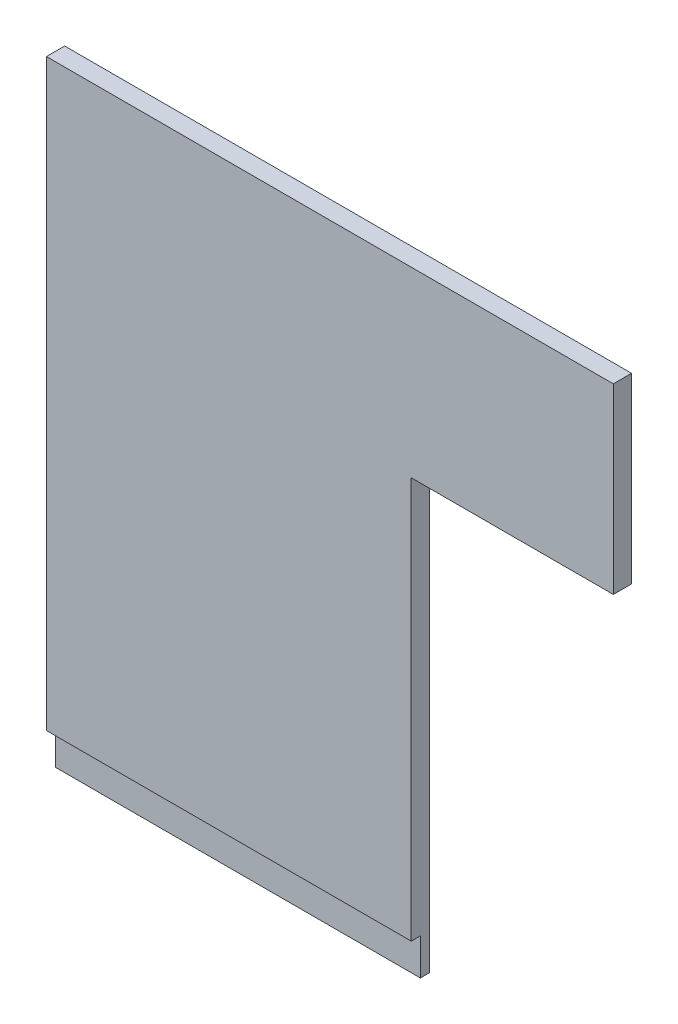
ISO-10303-21;
HEADER;
FILE_DESCRIPTION(('STEP AP214'),'2;1');
FILE_NAME('part.step','',(''),(''),'','','');
FILE_SCHEMA(('AUTOMOTIVE_DESIGN { 1 0 10303 214 1 1 1 1 }'));
ENDSEC;
DATA;
#1=APPLICATION_CONTEXT('core data for automotive mechanical design processes');
#2=APPLICATION_PROTOCOL_DEFINITION('international standard','automotive_design',2000,#1);
#3=PRODUCT_CONTEXT('',#1,'mechanical');
#4=PRODUCT('Part','Part','',(#3));
#5=PRODUCT_RELATED_PRODUCT_CATEGORY('part','',(#4));
#6=PRODUCT_DEFINITION_FORMATION('','',#4);
#7=PRODUCT_DEFINITION_CONTEXT('part definition',#1,'design');
#8=PRODUCT_DEFINITION('design','',#6,#7);
#9=PRODUCT_DEFINITION_SHAPE('','',#8);
#10=(LENGTH_UNIT() NAMED_UNIT(*) SI_UNIT(.MILLI.,.METRE.));
#11=(NAMED_UNIT(*) PLANE_ANGLE_UNIT() SI_UNIT($,.RADIAN.));
#12=(NAMED_UNIT(*) SI_UNIT($,.STERADIAN.) SOLID_ANGLE_UNIT());
#13=UNCERTAINTY_MEASURE_WITH_UNIT(LENGTH_MEASURE(1.E-05),#10,'distance_accuracy_value','');
#14=(GEOMETRIC_REPRESENTATION_CONTEXT(3) GLOBAL_UNCERTAINTY_ASSIGNED_CONTEXT((#13)) GLOBAL_UNIT_ASSIGNED_CONTEXT((#10,
#11,#12)) REPRESENTATION_CONTEXT('',''));
#15=CARTESIAN_POINT('',(0.,0.,0.));
#16=DIRECTION('',(0.,0.,1.));
#17=DIRECTION('',(1.,0.,0.));
#18=AXIS2_PLACEMENT_3D('',#15,#16,#17);
#19=CARTESIAN_POINT('',(0.,0.,3.175));
#20=DIRECTION('',(1.,0.,0.));
#21=DIRECTION('',(0.,0.,-1.));
#22=AXIS2_PLACEMENT_3D('',#19,#20,#21);
#23=PLANE('',#22);
#24=DIRECTION('',(0.,-1.,0.));
#25=VECTOR('',#24,1.);
#26=CARTESIAN_POINT('',(0.,0.,1.5875));
#27=LINE('',#26,#25);
#28=CARTESIAN_POINT('',(0.,6.35,1.5875));
#29=VERTEX_POINT('',#28);
#30=CARTESIAN_POINT('',(0.,0.,1.5875));
#31=VERTEX_POINT('',#30);
#32=EDGE_CURVE('E117',#29,#31,#27,.T.);
#33=ORIENTED_EDGE('',*,*,#32,.F.);
#34=DIRECTION('',(0.,0.,1.));
#35=VECTOR('',#34,1.);
#36=CARTESIAN_POINT('',(0.,6.35,1.5875));
#37=LINE('',#36,#35);
#38=CARTESIAN_POINT('',(0.,6.35,3.175));
#39=VERTEX_POINT('',#38);
#40=EDGE_CURVE('E145',#29,#39,#37,.T.);
#41=ORIENTED_EDGE('',*,*,#40,.T.);
#42=DIRECTION('',(0.,-1.,0.));
#43=VECTOR('',#42,1.);
#44=CARTESIAN_POINT('',(0.,0.,3.175));
#45=LINE('',#44,#43);
#46=CARTESIAN_POINT('',(0.,107.95,3.175));
#47=VERTEX_POINT('',#46);
#48=EDGE_CURVE('E166',#47,#39,#45,.T.);
#49=ORIENTED_EDGE('',*,*,#48,.F.);
#50=DIRECTION('',(0.,0.,-1.));
#51=VECTOR('',#50,1.);
#52=CARTESIAN_POINT('',(0.,107.95,3.175));
#53=LINE('',#52,#51);
#54=CARTESIAN_POINT('',(0.,107.95,0.));
#55=VERTEX_POINT('',#54);
#56=EDGE_CURVE('E141',#47,#55,#53,.T.);
#57=ORIENTED_EDGE('',*,*,#56,.T.);
#58=DIRECTION('',(0.,-1.,0.));
#59=VECTOR('',#58,1.);
#60=CARTESIAN_POINT('',(0.,0.,0.));
#61=LINE('',#60,#59);
#62=CARTESIAN_POINT('',(0.,0.,0.));
#63=VERTEX_POINT('',#62);
#64=EDGE_CURVE('E139',#55,#63,#61,.T.);
#65=ORIENTED_EDGE('',*,*,#64,.T.);
#66=DIRECTION('',(0.,0.,-1.));
#67=VECTOR('',#66,1.);
#68=CARTESIAN_POINT('',(0.,0.,3.175));
#69=LINE('',#68,#67);
#70=EDGE_CURVE('E12',#31,#63,#69,.T.);
#71=ORIENTED_EDGE('',*,*,#70,.F.);
#72=EDGE_LOOP('',(#33,#41,#49,#57,#65,#71));
#73=FACE_BOUND('',#72,.T.);
#74=ADVANCED_FACE('F44',(#73),#23,.F.);
#75=CARTESIAN_POINT('',(0.,0.,3.175));
#76=DIRECTION('',(0.,1.,0.));
#77=DIRECTION('',(0.,0.,1.));
#78=AXIS2_PLACEMENT_3D('',#75,#76,#77);
#79=PLANE('',#78);
#80=DIRECTION('',(0.,0.,-1.));
#81=VECTOR('',#80,1.);
#82=CARTESIAN_POINT('',(63.5,0.,3.175));
#83=LINE('',#82,#81);
#84=CARTESIAN_POINT('',(63.5,0.,1.5875));
#85=VERTEX_POINT('',#84);
#86=CARTESIAN_POINT('',(63.5,0.,0.));
#87=VERTEX_POINT('',#86);
#88=EDGE_CURVE('E52',#85,#87,#83,.T.);
#89=ORIENTED_EDGE('',*,*,#88,.F.);
#90=DIRECTION('',(1.,0.,0.));
#91=VECTOR('',#90,1.);
#92=CARTESIAN_POINT('',(0.,0.,1.5875));
#93=LINE('',#92,#91);
#94=EDGE_CURVE('E120',#31,#85,#93,.T.);
#95=ORIENTED_EDGE('',*,*,#94,.F.);
#96=ORIENTED_EDGE('',*,*,#70,.T.);
#97=DIRECTION('',(1.,0.,0.));
#98=VECTOR('',#97,1.);
#99=CARTESIAN_POINT('',(0.,0.,0.));
#100=LINE('',#99,#98);
#101=EDGE_CURVE('E144',#63,#87,#100,.T.);
#102=ORIENTED_EDGE('',*,*,#101,.T.);
#103=EDGE_LOOP('',(#89,#95,#96,#102));
#104=FACE_BOUND('',#103,.T.);
#105=ADVANCED_FACE('F131',(#104),#79,.F.);
#106=CARTESIAN_POINT('',(63.5,0.,3.175));
#107=DIRECTION('',(-1.,0.,0.));
#108=DIRECTION('',(0.,0.,1.));
#109=AXIS2_PLACEMENT_3D('',#106,#107,#108);
#110=PLANE('',#109);
#111=DIRECTION('',(0.,1.,0.));
#112=VECTOR('',#111,1.);
#113=CARTESIAN_POINT('',(63.5,0.,3.175));
#114=LINE('',#113,#112);
#115=CARTESIAN_POINT('',(63.5,6.35,3.175));
#116=VERTEX_POINT('',#115);
#117=CARTESIAN_POINT('',(63.5,76.2,3.175));
#118=VERTEX_POINT('',#117);
#119=EDGE_CURVE('E99',#116,#118,#114,.T.);
#120=ORIENTED_EDGE('',*,*,#119,.F.);
#121=DIRECTION('',(0.,0.,1.));
#122=VECTOR('',#121,1.);
#123=CARTESIAN_POINT('',(63.5,6.35,1.5875));
#124=LINE('',#123,#122);
#125=CARTESIAN_POINT('',(63.5,6.35,1.5875));
#126=VERTEX_POINT('',#125);
#127=EDGE_CURVE('E59',#126,#116,#124,.T.);
#128=ORIENTED_EDGE('',*,*,#127,.F.);
#129=DIRECTION('',(0.,1.,0.));
#130=VECTOR('',#129,1.);
#131=CARTESIAN_POINT('',(63.5,0.,1.5875));
#132=LINE('',#131,#130);
#133=EDGE_CURVE('E135',#85,#126,#132,.T.);
#134=ORIENTED_EDGE('',*,*,#133,.F.);
#135=ORIENTED_EDGE('',*,*,#88,.T.);
#136=DIRECTION('',(0.,1.,0.));
#137=VECTOR('',#136,1.);
#138=CARTESIAN_POINT('',(63.5,0.,0.));
#139=LINE('',#138,#137);
#140=CARTESIAN_POINT('',(63.5,76.2,0.));
#141=VERTEX_POINT('',#140);
#142=EDGE_CURVE('E149',#87,#141,#139,.T.);
#143=ORIENTED_EDGE('',*,*,#142,.T.);
#144=DIRECTION('',(0.,0.,-1.));
#145=VECTOR('',#144,1.);
#146=CARTESIAN_POINT('',(63.5,76.2,3.175));
#147=LINE('',#146,#145);
#148=EDGE_CURVE('E176',#118,#141,#147,.T.);
#149=ORIENTED_EDGE('',*,*,#148,.F.);
#150=EDGE_LOOP('',(#120,#128,#134,#135,#143,#149));
#151=FACE_BOUND('',#150,.T.);
#152=ADVANCED_FACE('F181',(#151),#110,.F.);
#153=CARTESIAN_POINT('',(63.5,76.2,3.175));
#154=DIRECTION('',(0.,1.,0.));
#155=DIRECTION('',(-1.,0.,0.));
#156=AXIS2_PLACEMENT_3D('',#153,#154,#155);
#157=PLANE('',#156);
#158=DIRECTION('',(1.,0.,0.));
#159=VECTOR('',#158,1.);
#160=CARTESIAN_POINT('',(63.5,76.2,0.));
#161=LINE('',#160,#159);
#162=CARTESIAN_POINT('',(98.679,76.2,0.));
#163=VERTEX_POINT('',#162);
#164=EDGE_CURVE('E157',#141,#163,#161,.T.);
#165=ORIENTED_EDGE('',*,*,#164,.T.);
#166=DIRECTION('',(0.,0.,-1.));
#167=VECTOR('',#166,1.);
#168=CARTESIAN_POINT('',(98.679,76.2,3.175));
#169=LINE('',#168,#167);
#170=CARTESIAN_POINT('',(98.679,76.2,3.175));
#171=VERTEX_POINT('',#170);
#172=EDGE_CURVE('E172',#171,#163,#169,.T.);
#173=ORIENTED_EDGE('',*,*,#172,.F.);
#174=DIRECTION('',(1.,0.,0.));
#175=VECTOR('',#174,1.);
#176=CARTESIAN_POINT('',(63.5,76.2,3.175));
#177=LINE('',#176,#175);
#178=EDGE_CURVE('E196',#118,#171,#177,.T.);
#179=ORIENTED_EDGE('',*,*,#178,.F.);
#180=ORIENTED_EDGE('',*,*,#148,.T.);
#181=EDGE_LOOP('',(#165,#173,#179,#180));
#182=FACE_BOUND('',#181,.T.);
#183=ADVANCED_FACE('F188',(#182),#157,.F.);
#184=CARTESIAN_POINT('',(98.679,107.95,3.175));
#185=DIRECTION('',(-1.,0.,0.));
#186=DIRECTION('',(0.,0.,1.));
#187=AXIS2_PLACEMENT_3D('',#184,#185,#186);
#188=PLANE('',#187);
#189=DIRECTION('',(0.,1.,0.));
#190=VECTOR('',#189,1.);
#191=CARTESIAN_POINT('',(98.679,107.95,0.));
#192=LINE('',#191,#190);
#193=CARTESIAN_POINT('',(98.679,107.95,0.));
#194=VERTEX_POINT('',#193);
#195=EDGE_CURVE('E160',#163,#194,#192,.T.);
#196=ORIENTED_EDGE('',*,*,#195,.T.);
#197=DIRECTION('',(0.,0.,-1.));
#198=VECTOR('',#197,1.);
#199=CARTESIAN_POINT('',(98.679,107.95,3.175));
#200=LINE('',#199,#198);
#201=CARTESIAN_POINT('',(98.679,107.95,3.175));
#202=VERTEX_POINT('',#201);
#203=EDGE_CURVE('E169',#202,#194,#200,.T.);
#204=ORIENTED_EDGE('',*,*,#203,.F.);
#205=DIRECTION('',(0.,1.,0.));
#206=VECTOR('',#205,1.);
#207=CARTESIAN_POINT('',(98.679,107.95,3.175));
#208=LINE('',#207,#206);
#209=EDGE_CURVE('E194',#171,#202,#208,.T.);
#210=ORIENTED_EDGE('',*,*,#209,.F.);
#211=ORIENTED_EDGE('',*,*,#172,.T.);
#212=EDGE_LOOP('',(#196,#204,#210,#211));
#213=FACE_BOUND('',#212,.T.);
#214=ADVANCED_FACE('F192',(#213),#188,.F.);
#215=CARTESIAN_POINT('',(0.,107.95,3.175));
#216=DIRECTION('',(0.,-1.,0.));
#217=DIRECTION('',(0.,0.,-1.));
#218=AXIS2_PLACEMENT_3D('',#215,#216,#217);
#219=PLANE('',#218);
#220=DIRECTION('',(-1.,0.,0.));
#221=VECTOR('',#220,1.);
#222=CARTESIAN_POINT('',(0.,107.95,0.));
#223=LINE('',#222,#221);
#224=EDGE_CURVE('E93',#194,#55,#223,.T.);
#225=ORIENTED_EDGE('',*,*,#224,.T.);
#226=ORIENTED_EDGE('',*,*,#56,.F.);
#227=DIRECTION('',(-1.,0.,0.));
#228=VECTOR('',#227,1.);
#229=CARTESIAN_POINT('',(63.5,107.95,3.175));
#230=LINE('',#229,#228);
#231=EDGE_CURVE('E68',#202,#47,#230,.T.);
#232=ORIENTED_EDGE('',*,*,#231,.F.);
#233=ORIENTED_EDGE('',*,*,#203,.T.);
#234=EDGE_LOOP('',(#225,#226,#232,#233));
#235=FACE_BOUND('',#234,.T.);
#236=ADVANCED_FACE('F215',(#235),#219,.F.);
#237=CARTESIAN_POINT('',(0.,0.,3.175));
#238=DIRECTION('',(0.,0.,-1.));
#239=DIRECTION('',(-1.,0.,0.));
#240=AXIS2_PLACEMENT_3D('',#237,#238,#239);
#241=PLANE('',#240);
#242=ORIENTED_EDGE('',*,*,#48,.T.);
#243=DIRECTION('',(-1.,0.,0.));
#244=VECTOR('',#243,1.);
#245=CARTESIAN_POINT('',(0.,6.35,3.175));
#246=LINE('',#245,#244);
#247=EDGE_CURVE('E127',#116,#39,#246,.T.);
#248=ORIENTED_EDGE('',*,*,#247,.F.);
#249=ORIENTED_EDGE('',*,*,#119,.T.);
#250=ORIENTED_EDGE('',*,*,#178,.T.);
#251=ORIENTED_EDGE('',*,*,#209,.T.);
#252=ORIENTED_EDGE('',*,*,#231,.T.);
#253=EDGE_LOOP('',(#242,#248,#249,#250,#251,#252));
#254=FACE_BOUND('',#253,.T.);
#255=ADVANCED_FACE('F213',(#254),#241,.F.);
#256=CARTESIAN_POINT('',(0.,0.,0.));
#257=DIRECTION('',(0.,0.,-1.));
#258=DIRECTION('',(-1.,0.,0.));
#259=AXIS2_PLACEMENT_3D('',#256,#257,#258);
#260=PLANE('',#259);
#261=ORIENTED_EDGE('',*,*,#64,.F.);
#262=ORIENTED_EDGE('',*,*,#224,.F.);
#263=ORIENTED_EDGE('',*,*,#195,.F.);
#264=ORIENTED_EDGE('',*,*,#164,.F.);
#265=ORIENTED_EDGE('',*,*,#142,.F.);
#266=ORIENTED_EDGE('',*,*,#101,.F.);
#267=EDGE_LOOP('',(#261,#262,#263,#264,#265,#266));
#268=FACE_BOUND('',#267,.T.);
#269=ADVANCED_FACE('F184',(#268),#260,.T.);
#270=CARTESIAN_POINT('',(0.,6.35,1.5875));
#271=DIRECTION('',(0.,1.,0.));
#272=DIRECTION('',(0.,0.,1.));
#273=AXIS2_PLACEMENT_3D('',#270,#271,#272);
#274=PLANE('',#273);
#275=ORIENTED_EDGE('',*,*,#247,.T.);
#276=ORIENTED_EDGE('',*,*,#40,.F.);
#277=DIRECTION('',(-1.,0.,0.));
#278=VECTOR('',#277,1.);
#279=CARTESIAN_POINT('',(0.,6.35,1.5875));
#280=LINE('',#279,#278);
#281=EDGE_CURVE('E122',#126,#29,#280,.T.);
#282=ORIENTED_EDGE('',*,*,#281,.F.);
#283=ORIENTED_EDGE('',*,*,#127,.T.);
#284=EDGE_LOOP('',(#275,#276,#282,#283));
#285=FACE_BOUND('',#284,.T.);
#286=ADVANCED_FACE('F212',(#285),#274,.F.);
#287=CARTESIAN_POINT('',(0.,0.,1.5875));
#288=DIRECTION('',(0.,0.,-1.));
#289=DIRECTION('',(-1.,0.,0.));
#290=AXIS2_PLACEMENT_3D('',#287,#288,#289);
#291=PLANE('',#290);
#292=ORIENTED_EDGE('',*,*,#32,.T.);
#293=ORIENTED_EDGE('',*,*,#94,.T.);
#294=ORIENTED_EDGE('',*,*,#133,.T.);
#295=ORIENTED_EDGE('',*,*,#281,.T.);
#296=EDGE_LOOP('',(#292,#293,#294,#295));
#297=FACE_BOUND('',#296,.T.);
#298=ADVANCED_FACE('F119',(#297),#291,.F.);
#299=CLOSED_SHELL('',(#74,#105,#152,#183,#214,#236,#255,#269,#286,#298));
#300=MANIFOLD_SOLID_BREP('B2',#299);
#301=ADVANCED_BREP_SHAPE_REPRESENTATION('',(#18,#300),#14);
#302=SHAPE_DEFINITION_REPRESENTATION(#9,#301);
ENDSEC;
END-ISO-10303-21;
